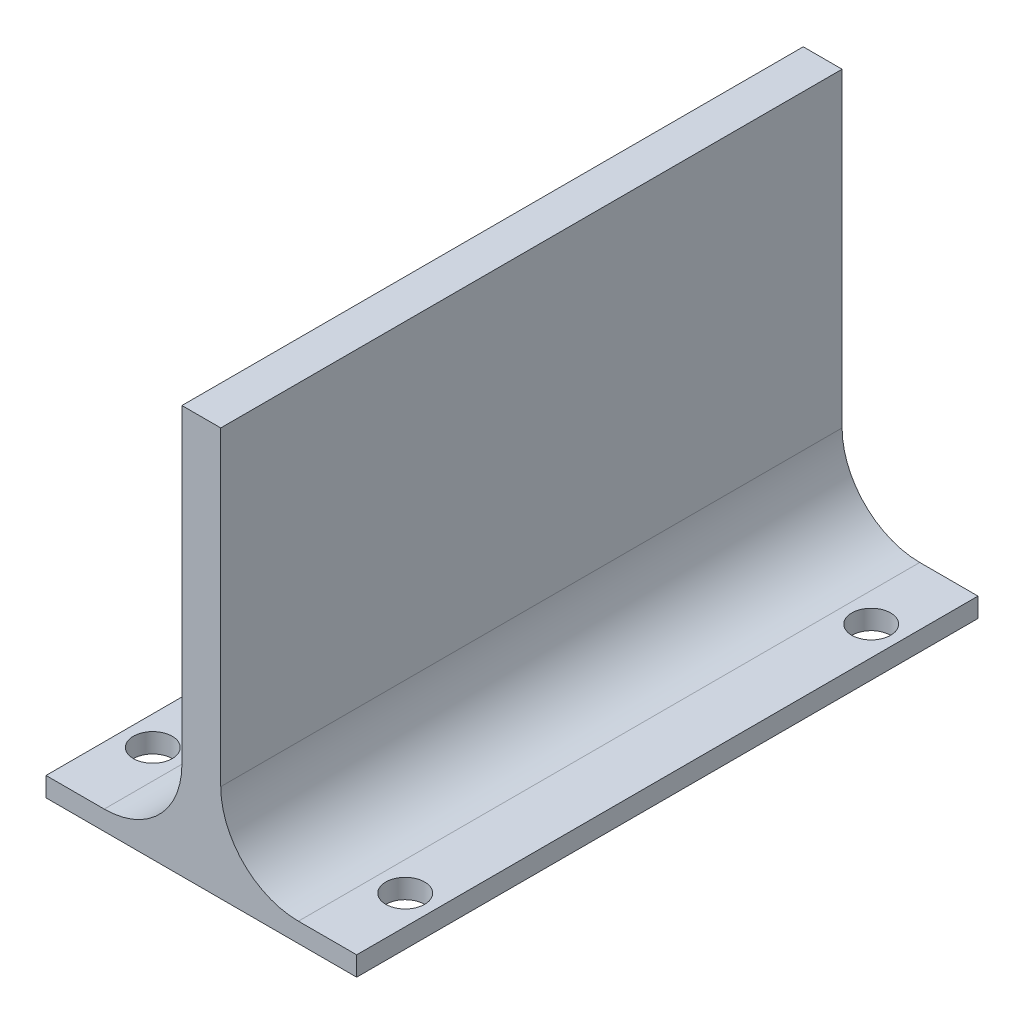
ISO-10303-21;
HEADER;
FILE_DESCRIPTION(('STEP AP214'),'2;1');
FILE_NAME('part.step','',(''),(''),'','','');
FILE_SCHEMA(('AUTOMOTIVE_DESIGN { 1 0 10303 214 1 1 1 1 }'));
ENDSEC;
DATA;
#1=APPLICATION_CONTEXT('core data for automotive mechanical design processes');
#2=APPLICATION_PROTOCOL_DEFINITION('international standard','automotive_design',2000,#1);
#3=PRODUCT_CONTEXT('',#1,'mechanical');
#4=PRODUCT('Part','Part','',(#3));
#5=PRODUCT_RELATED_PRODUCT_CATEGORY('part','',(#4));
#6=PRODUCT_DEFINITION_FORMATION('','',#4);
#7=PRODUCT_DEFINITION_CONTEXT('part definition',#1,'design');
#8=PRODUCT_DEFINITION('design','',#6,#7);
#9=PRODUCT_DEFINITION_SHAPE('','',#8);
#10=(LENGTH_UNIT() NAMED_UNIT(*) SI_UNIT(.MILLI.,.METRE.));
#11=(NAMED_UNIT(*) PLANE_ANGLE_UNIT() SI_UNIT($,.RADIAN.));
#12=(NAMED_UNIT(*) SI_UNIT($,.STERADIAN.) SOLID_ANGLE_UNIT());
#13=UNCERTAINTY_MEASURE_WITH_UNIT(LENGTH_MEASURE(1.E-05),#10,'distance_accuracy_value','');
#14=(GEOMETRIC_REPRESENTATION_CONTEXT(3) GLOBAL_UNCERTAINTY_ASSIGNED_CONTEXT((#13)) GLOBAL_UNIT_ASSIGNED_CONTEXT((#10,
#11,#12)) REPRESENTATION_CONTEXT('',''));
#15=CARTESIAN_POINT('',(0.,0.,0.));
#16=DIRECTION('',(0.,0.,1.));
#17=DIRECTION('',(1.,0.,0.));
#18=AXIS2_PLACEMENT_3D('',#15,#16,#17);
#19=CARTESIAN_POINT('',(35.,0.,160.));
#20=DIRECTION('',(-1.,0.,0.));
#21=DIRECTION('',(0.,0.,1.));
#22=AXIS2_PLACEMENT_3D('',#19,#20,#21);
#23=PLANE('',#22);
#24=DIRECTION('',(0.,1.,0.));
#25=VECTOR('',#24,1.);
#26=CARTESIAN_POINT('',(35.,0.,0.));
#27=LINE('',#26,#25);
#28=CARTESIAN_POINT('',(35.,20.,0.));
#29=VERTEX_POINT('',#28);
#30=CARTESIAN_POINT('',(35.,100.,0.));
#31=VERTEX_POINT('',#30);
#32=EDGE_CURVE('E166',#29,#31,#27,.T.);
#33=ORIENTED_EDGE('',*,*,#32,.F.);
#34=DIRECTION('',(0.,0.,-1.));
#35=VECTOR('',#34,1.);
#36=CARTESIAN_POINT('',(35.,20.,160.));
#37=LINE('',#36,#35);
#38=CARTESIAN_POINT('',(35.,20.,160.));
#39=VERTEX_POINT('',#38);
#40=EDGE_CURVE('E193',#29,#39,#37,.F.);
#41=ORIENTED_EDGE('',*,*,#40,.T.);
#42=DIRECTION('',(0.,1.,0.));
#43=VECTOR('',#42,1.);
#44=CARTESIAN_POINT('',(35.,0.,160.));
#45=LINE('',#44,#43);
#46=CARTESIAN_POINT('',(35.,100.,160.));
#47=VERTEX_POINT('',#46);
#48=EDGE_CURVE('E146',#39,#47,#45,.T.);
#49=ORIENTED_EDGE('',*,*,#48,.T.);
#50=DIRECTION('',(0.,0.,-1.));
#51=VECTOR('',#50,1.);
#52=CARTESIAN_POINT('',(35.,100.,160.));
#53=LINE('',#52,#51);
#54=EDGE_CURVE('E165',#47,#31,#53,.T.);
#55=ORIENTED_EDGE('',*,*,#54,.T.);
#56=EDGE_LOOP('',(#33,#41,#49,#55));
#57=FACE_BOUND('',#56,.T.);
#58=ADVANCED_FACE('F43',(#57),#23,.T.);
#59=CARTESIAN_POINT('',(0.,0.,160.));
#60=DIRECTION('',(0.,1.,0.));
#61=DIRECTION('',(0.,0.,1.));
#62=AXIS2_PLACEMENT_3D('',#59,#60,#61);
#63=PLANE('',#62);
#64=CARTESIAN_POINT('',(7.5,0.,20.));
#65=DIRECTION('',(0.,1.,0.));
#66=DIRECTION('',(0.,0.,1.));
#67=AXIS2_PLACEMENT_3D('',#64,#65,#66);
#68=CIRCLE('',#67,5.);
#69=CARTESIAN_POINT('',(7.5,0.,25.));
#70=VERTEX_POINT('',#69);
#71=EDGE_CURVE('E220',#70,#70,#68,.T.);
#72=ORIENTED_EDGE('',*,*,#71,.F.);
#73=EDGE_LOOP('',(#72));
#74=FACE_BOUND('',#73,.T.);
#75=CARTESIAN_POINT('',(7.5,0.,140.));
#76=DIRECTION('',(0.,1.,0.));
#77=DIRECTION('',(0.,0.,1.));
#78=AXIS2_PLACEMENT_3D('',#75,#76,#77);
#79=CIRCLE('',#78,5.);
#80=CARTESIAN_POINT('',(7.5,0.,145.));
#81=VERTEX_POINT('',#80);
#82=EDGE_CURVE('E223',#81,#81,#79,.T.);
#83=ORIENTED_EDGE('',*,*,#82,.F.);
#84=EDGE_LOOP('',(#83));
#85=FACE_BOUND('',#84,.T.);
#86=DIRECTION('',(1.,0.,0.));
#87=VECTOR('',#86,1.);
#88=CARTESIAN_POINT('',(0.,0.,160.));
#89=LINE('',#88,#87);
#90=CARTESIAN_POINT('',(0.,0.,160.));
#91=VERTEX_POINT('',#90);
#92=CARTESIAN_POINT('',(15.,0.,160.));
#93=VERTEX_POINT('',#92);
#94=EDGE_CURVE('E125',#91,#93,#89,.T.);
#95=ORIENTED_EDGE('',*,*,#94,.T.);
#96=DIRECTION('',(0.,0.,-1.));
#97=VECTOR('',#96,1.);
#98=CARTESIAN_POINT('',(15.,0.,0.));
#99=LINE('',#98,#97);
#100=CARTESIAN_POINT('',(15.,0.,0.));
#101=VERTEX_POINT('',#100);
#102=EDGE_CURVE('E131',#93,#101,#99,.T.);
#103=ORIENTED_EDGE('',*,*,#102,.T.);
#104=DIRECTION('',(1.,0.,0.));
#105=VECTOR('',#104,1.);
#106=CARTESIAN_POINT('',(0.,0.,0.));
#107=LINE('',#106,#105);
#108=CARTESIAN_POINT('',(0.,0.,0.));
#109=VERTEX_POINT('',#108);
#110=EDGE_CURVE('E128',#109,#101,#107,.T.);
#111=ORIENTED_EDGE('',*,*,#110,.F.);
#112=DIRECTION('',(0.,0.,-1.));
#113=VECTOR('',#112,1.);
#114=CARTESIAN_POINT('',(0.,0.,160.));
#115=LINE('',#114,#113);
#116=EDGE_CURVE('E120',#91,#109,#115,.T.);
#117=ORIENTED_EDGE('',*,*,#116,.F.);
#118=EDGE_LOOP('',(#95,#103,#111,#117));
#119=FACE_BOUND('',#118,.T.);
#120=ADVANCED_FACE('F122',(#74,#85,#119),#63,.T.);
#121=CARTESIAN_POINT('',(0.,0.,160.));
#122=DIRECTION('',(1.,0.,0.));
#123=DIRECTION('',(0.,0.,-1.));
#124=AXIS2_PLACEMENT_3D('',#121,#122,#123);
#125=PLANE('',#124);
#126=DIRECTION('',(0.,-1.,0.));
#127=VECTOR('',#126,1.);
#128=CARTESIAN_POINT('',(0.,0.,0.));
#129=LINE('',#128,#127);
#130=CARTESIAN_POINT('',(0.,-5.,0.));
#131=VERTEX_POINT('',#130);
#132=EDGE_CURVE('E169',#109,#131,#129,.T.);
#133=ORIENTED_EDGE('',*,*,#132,.T.);
#134=DIRECTION('',(0.,0.,-1.));
#135=VECTOR('',#134,1.);
#136=CARTESIAN_POINT('',(0.,-5.,160.));
#137=LINE('',#136,#135);
#138=CARTESIAN_POINT('',(0.,-5.,160.));
#139=VERTEX_POINT('',#138);
#140=EDGE_CURVE('E132',#139,#131,#137,.T.);
#141=ORIENTED_EDGE('',*,*,#140,.F.);
#142=DIRECTION('',(0.,-1.,0.));
#143=VECTOR('',#142,1.);
#144=CARTESIAN_POINT('',(0.,0.,160.));
#145=LINE('',#144,#143);
#146=EDGE_CURVE('E135',#91,#139,#145,.T.);
#147=ORIENTED_EDGE('',*,*,#146,.F.);
#148=ORIENTED_EDGE('',*,*,#116,.T.);
#149=EDGE_LOOP('',(#133,#141,#147,#148));
#150=FACE_BOUND('',#149,.T.);
#151=ADVANCED_FACE('F136',(#150),#125,.F.);
#152=CARTESIAN_POINT('',(0.,-5.,160.));
#153=DIRECTION('',(0.,1.,0.));
#154=DIRECTION('',(0.,0.,1.));
#155=AXIS2_PLACEMENT_3D('',#152,#153,#154);
#156=PLANE('',#155);
#157=CARTESIAN_POINT('',(7.5,-5.,20.));
#158=DIRECTION('',(0.,1.,0.));
#159=DIRECTION('',(0.,0.,1.));
#160=AXIS2_PLACEMENT_3D('',#157,#158,#159);
#161=CIRCLE('',#160,5.);
#162=CARTESIAN_POINT('',(7.5,-5.,25.));
#163=VERTEX_POINT('',#162);
#164=EDGE_CURVE('E47',#163,#163,#161,.T.);
#165=ORIENTED_EDGE('',*,*,#164,.T.);
#166=EDGE_LOOP('',(#165));
#167=FACE_BOUND('',#166,.T.);
#168=CARTESIAN_POINT('',(7.5,-5.,140.));
#169=DIRECTION('',(0.,1.,0.));
#170=DIRECTION('',(0.,0.,1.));
#171=AXIS2_PLACEMENT_3D('',#168,#169,#170);
#172=CIRCLE('',#171,5.);
#173=CARTESIAN_POINT('',(7.5,-5.,145.));
#174=VERTEX_POINT('',#173);
#175=EDGE_CURVE('E202',#174,#174,#172,.T.);
#176=ORIENTED_EDGE('',*,*,#175,.T.);
#177=EDGE_LOOP('',(#176));
#178=FACE_BOUND('',#177,.T.);
#179=CARTESIAN_POINT('',(72.5,-5.,140.));
#180=DIRECTION('',(0.,1.,0.));
#181=DIRECTION('',(0.,0.,1.));
#182=AXIS2_PLACEMENT_3D('',#179,#180,#181);
#183=CIRCLE('',#182,5.00000000000001);
#184=CARTESIAN_POINT('',(72.5,-5.,145.));
#185=VERTEX_POINT('',#184);
#186=EDGE_CURVE('E204',#185,#185,#183,.T.);
#187=ORIENTED_EDGE('',*,*,#186,.T.);
#188=EDGE_LOOP('',(#187));
#189=FACE_BOUND('',#188,.T.);
#190=CARTESIAN_POINT('',(72.5,-5.,20.));
#191=DIRECTION('',(0.,1.,0.));
#192=DIRECTION('',(0.,0.,1.));
#193=AXIS2_PLACEMENT_3D('',#190,#191,#192);
#194=CIRCLE('',#193,5.);
#195=CARTESIAN_POINT('',(72.5,-5.,25.));
#196=VERTEX_POINT('',#195);
#197=EDGE_CURVE('E209',#196,#196,#194,.T.);
#198=ORIENTED_EDGE('',*,*,#197,.T.);
#199=EDGE_LOOP('',(#198));
#200=FACE_BOUND('',#199,.T.);
#201=DIRECTION('',(1.,0.,0.));
#202=VECTOR('',#201,1.);
#203=CARTESIAN_POINT('',(0.,-5.,0.));
#204=LINE('',#203,#202);
#205=CARTESIAN_POINT('',(80.,-5.,0.));
#206=VERTEX_POINT('',#205);
#207=EDGE_CURVE('E172',#131,#206,#204,.T.);
#208=ORIENTED_EDGE('',*,*,#207,.T.);
#209=DIRECTION('',(0.,0.,-1.));
#210=VECTOR('',#209,1.);
#211=CARTESIAN_POINT('',(80.,-5.,160.));
#212=LINE('',#211,#210);
#213=CARTESIAN_POINT('',(80.,-5.,160.));
#214=VERTEX_POINT('',#213);
#215=EDGE_CURVE('E189',#214,#206,#212,.T.);
#216=ORIENTED_EDGE('',*,*,#215,.F.);
#217=DIRECTION('',(1.,0.,0.));
#218=VECTOR('',#217,1.);
#219=CARTESIAN_POINT('',(0.,-5.,160.));
#220=LINE('',#219,#218);
#221=EDGE_CURVE('E140',#139,#214,#220,.T.);
#222=ORIENTED_EDGE('',*,*,#221,.F.);
#223=ORIENTED_EDGE('',*,*,#140,.T.);
#224=EDGE_LOOP('',(#208,#216,#222,#223));
#225=FACE_BOUND('',#224,.T.);
#226=ADVANCED_FACE('F259',(#167,#178,#189,#200,#225),#156,.F.);
#227=CARTESIAN_POINT('',(80.,2.22044604925031E-13,160.));
#228=DIRECTION('',(1.,0.,0.));
#229=DIRECTION('',(0.,1.,0.));
#230=AXIS2_PLACEMENT_3D('',#227,#228,#229);
#231=PLANE('',#230);
#232=DIRECTION('',(0.,-1.,0.));
#233=VECTOR('',#232,1.);
#234=CARTESIAN_POINT('',(80.,2.22044604925031E-13,0.));
#235=LINE('',#234,#233);
#236=CARTESIAN_POINT('',(80.,0.,0.));
#237=VERTEX_POINT('',#236);
#238=EDGE_CURVE('E175',#237,#206,#235,.T.);
#239=ORIENTED_EDGE('',*,*,#238,.F.);
#240=DIRECTION('',(0.,0.,-1.));
#241=VECTOR('',#240,1.);
#242=CARTESIAN_POINT('',(80.,0.,160.));
#243=LINE('',#242,#241);
#244=CARTESIAN_POINT('',(80.,0.,160.));
#245=VERTEX_POINT('',#244);
#246=EDGE_CURVE('E187',#245,#237,#243,.T.);
#247=ORIENTED_EDGE('',*,*,#246,.F.);
#248=DIRECTION('',(0.,-1.,0.));
#249=VECTOR('',#248,1.);
#250=CARTESIAN_POINT('',(80.,2.22044604925031E-13,160.));
#251=LINE('',#250,#249);
#252=EDGE_CURVE('E152',#245,#214,#251,.T.);
#253=ORIENTED_EDGE('',*,*,#252,.T.);
#254=ORIENTED_EDGE('',*,*,#215,.T.);
#255=EDGE_LOOP('',(#239,#247,#253,#254));
#256=FACE_BOUND('',#255,.T.);
#257=ADVANCED_FACE('F236',(#256),#231,.T.);
#258=CARTESIAN_POINT('',(72.5,0.,140.));
#259=DIRECTION('',(0.,1.,0.));
#260=DIRECTION('',(0.,0.,1.));
#261=AXIS2_PLACEMENT_3D('',#258,#259,#260);
#262=CIRCLE('',#261,5.00000000000001);
#263=CARTESIAN_POINT('',(72.5,0.,145.));
#264=VERTEX_POINT('',#263);
#265=EDGE_CURVE('E219',#264,#264,#262,.T.);
#266=ORIENTED_EDGE('',*,*,#265,.F.);
#267=EDGE_LOOP('',(#266));
#268=FACE_BOUND('',#267,.T.);
#269=CARTESIAN_POINT('',(72.5,0.,20.));
#270=DIRECTION('',(0.,1.,0.));
#271=DIRECTION('',(0.,0.,1.));
#272=AXIS2_PLACEMENT_3D('',#269,#270,#271);
#273=CIRCLE('',#272,5.);
#274=CARTESIAN_POINT('',(72.5,0.,25.));
#275=VERTEX_POINT('',#274);
#276=EDGE_CURVE('E214',#275,#275,#273,.T.);
#277=ORIENTED_EDGE('',*,*,#276,.F.);
#278=EDGE_LOOP('',(#277));
#279=FACE_BOUND('',#278,.T.);
#280=CARTESIAN_POINT('',(65.,0.,0.));
#281=VERTEX_POINT('',#280);
#282=EDGE_CURVE('E170',#281,#237,#107,.T.);
#283=ORIENTED_EDGE('',*,*,#282,.F.);
#284=DIRECTION('',(0.,0.,-1.));
#285=VECTOR('',#284,1.);
#286=CARTESIAN_POINT('',(65.,0.,160.));
#287=LINE('',#286,#285);
#288=CARTESIAN_POINT('',(65.,0.,160.));
#289=VERTEX_POINT('',#288);
#290=EDGE_CURVE('E60',#281,#289,#287,.F.);
#291=ORIENTED_EDGE('',*,*,#290,.T.);
#292=EDGE_CURVE('E148',#289,#245,#89,.T.);
#293=ORIENTED_EDGE('',*,*,#292,.T.);
#294=ORIENTED_EDGE('',*,*,#246,.T.);
#295=EDGE_LOOP('',(#283,#291,#293,#294));
#296=FACE_BOUND('',#295,.T.);
#297=ADVANCED_FACE('F232',(#268,#279,#296),#63,.T.);
#298=CARTESIAN_POINT('',(45.,0.,160.));
#299=DIRECTION('',(-1.,0.,0.));
#300=DIRECTION('',(0.,0.,1.));
#301=AXIS2_PLACEMENT_3D('',#298,#299,#300);
#302=PLANE('',#301);
#303=DIRECTION('',(0.,1.,0.));
#304=VECTOR('',#303,1.);
#305=CARTESIAN_POINT('',(45.,0.,160.));
#306=LINE('',#305,#304);
#307=CARTESIAN_POINT('',(45.,20.,160.));
#308=VERTEX_POINT('',#307);
#309=CARTESIAN_POINT('',(45.,100.,160.));
#310=VERTEX_POINT('',#309);
#311=EDGE_CURVE('E151',#308,#310,#306,.T.);
#312=ORIENTED_EDGE('',*,*,#311,.F.);
#313=DIRECTION('',(0.,0.,-1.));
#314=VECTOR('',#313,1.);
#315=CARTESIAN_POINT('',(45.,20.,160.));
#316=LINE('',#315,#314);
#317=CARTESIAN_POINT('',(45.,20.,0.));
#318=VERTEX_POINT('',#317);
#319=EDGE_CURVE('E195',#308,#318,#316,.T.);
#320=ORIENTED_EDGE('',*,*,#319,.T.);
#321=DIRECTION('',(0.,1.,0.));
#322=VECTOR('',#321,1.);
#323=CARTESIAN_POINT('',(45.,0.,0.));
#324=LINE('',#323,#322);
#325=CARTESIAN_POINT('',(45.,100.,0.));
#326=VERTEX_POINT('',#325);
#327=EDGE_CURVE('E178',#318,#326,#324,.T.);
#328=ORIENTED_EDGE('',*,*,#327,.T.);
#329=DIRECTION('',(0.,0.,-1.));
#330=VECTOR('',#329,1.);
#331=CARTESIAN_POINT('',(45.,100.,160.));
#332=LINE('',#331,#330);
#333=EDGE_CURVE('E184',#310,#326,#332,.T.);
#334=ORIENTED_EDGE('',*,*,#333,.F.);
#335=EDGE_LOOP('',(#312,#320,#328,#334));
#336=FACE_BOUND('',#335,.T.);
#337=ADVANCED_FACE('F235',(#336),#302,.F.);
#338=CARTESIAN_POINT('',(0.,100.,160.));
#339=DIRECTION('',(0.,1.,0.));
#340=DIRECTION('',(0.,0.,1.));
#341=AXIS2_PLACEMENT_3D('',#338,#339,#340);
#342=PLANE('',#341);
#343=DIRECTION('',(1.,0.,0.));
#344=VECTOR('',#343,1.);
#345=CARTESIAN_POINT('',(0.,100.,0.));
#346=LINE('',#345,#344);
#347=EDGE_CURVE('E149',#31,#326,#346,.T.);
#348=ORIENTED_EDGE('',*,*,#347,.F.);
#349=ORIENTED_EDGE('',*,*,#54,.F.);
#350=DIRECTION('',(1.,0.,0.));
#351=VECTOR('',#350,1.);
#352=CARTESIAN_POINT('',(0.,100.,160.));
#353=LINE('',#352,#351);
#354=EDGE_CURVE('E155',#47,#310,#353,.T.);
#355=ORIENTED_EDGE('',*,*,#354,.T.);
#356=ORIENTED_EDGE('',*,*,#333,.T.);
#357=EDGE_LOOP('',(#348,#349,#355,#356));
#358=FACE_BOUND('',#357,.T.);
#359=ADVANCED_FACE('F250',(#358),#342,.T.);
#360=CARTESIAN_POINT('',(0.,0.,160.));
#361=DIRECTION('',(0.,0.,1.));
#362=DIRECTION('',(1.,0.,0.));
#363=AXIS2_PLACEMENT_3D('',#360,#361,#362);
#364=PLANE('',#363);
#365=ORIENTED_EDGE('',*,*,#48,.F.);
#366=CARTESIAN_POINT('',(15.,20.,160.));
#367=DIRECTION('',(0.,0.,1.));
#368=DIRECTION('',(1.,0.,0.));
#369=AXIS2_PLACEMENT_3D('',#366,#367,#368);
#370=CIRCLE('',#369,20.);
#371=EDGE_CURVE('E145',#39,#93,#370,.F.);
#372=ORIENTED_EDGE('',*,*,#371,.T.);
#373=ORIENTED_EDGE('',*,*,#94,.F.);
#374=ORIENTED_EDGE('',*,*,#146,.T.);
#375=ORIENTED_EDGE('',*,*,#221,.T.);
#376=ORIENTED_EDGE('',*,*,#252,.F.);
#377=ORIENTED_EDGE('',*,*,#292,.F.);
#378=CARTESIAN_POINT('',(65.,20.,160.));
#379=DIRECTION('',(0.,0.,1.));
#380=DIRECTION('',(1.,0.,0.));
#381=AXIS2_PLACEMENT_3D('',#378,#379,#380);
#382=CIRCLE('',#381,20.);
#383=EDGE_CURVE('E11',#289,#308,#382,.F.);
#384=ORIENTED_EDGE('',*,*,#383,.T.);
#385=ORIENTED_EDGE('',*,*,#311,.T.);
#386=ORIENTED_EDGE('',*,*,#354,.F.);
#387=EDGE_LOOP('',(#365,#372,#373,#374,#375,#376,#377,#384,#385,#386));
#388=FACE_BOUND('',#387,.T.);
#389=ADVANCED_FACE('F143',(#388),#364,.T.);
#390=CARTESIAN_POINT('',(0.,0.,0.));
#391=DIRECTION('',(0.,0.,1.));
#392=DIRECTION('',(1.,0.,0.));
#393=AXIS2_PLACEMENT_3D('',#390,#391,#392);
#394=PLANE('',#393);
#395=ORIENTED_EDGE('',*,*,#110,.T.);
#396=CARTESIAN_POINT('',(15.,20.,0.));
#397=DIRECTION('',(0.,0.,1.));
#398=DIRECTION('',(1.,0.,0.));
#399=AXIS2_PLACEMENT_3D('',#396,#397,#398);
#400=CIRCLE('',#399,20.);
#401=EDGE_CURVE('E199',#101,#29,#400,.T.);
#402=ORIENTED_EDGE('',*,*,#401,.T.);
#403=ORIENTED_EDGE('',*,*,#32,.T.);
#404=ORIENTED_EDGE('',*,*,#347,.T.);
#405=ORIENTED_EDGE('',*,*,#327,.F.);
#406=CARTESIAN_POINT('',(65.,20.,0.));
#407=DIRECTION('',(0.,0.,1.));
#408=DIRECTION('',(1.,0.,0.));
#409=AXIS2_PLACEMENT_3D('',#406,#407,#408);
#410=CIRCLE('',#409,20.);
#411=EDGE_CURVE('E52',#318,#281,#410,.T.);
#412=ORIENTED_EDGE('',*,*,#411,.T.);
#413=ORIENTED_EDGE('',*,*,#282,.T.);
#414=ORIENTED_EDGE('',*,*,#238,.T.);
#415=ORIENTED_EDGE('',*,*,#207,.F.);
#416=ORIENTED_EDGE('',*,*,#132,.F.);
#417=EDGE_LOOP('',(#395,#402,#403,#404,#405,#412,#413,#414,#415,#416));
#418=FACE_BOUND('',#417,.T.);
#419=ADVANCED_FACE('F255',(#418),#394,.F.);
#420=CARTESIAN_POINT('',(15.,20.,160.));
#421=DIRECTION('',(0.,0.,1.));
#422=DIRECTION('',(1.,0.,0.));
#423=AXIS2_PLACEMENT_3D('',#420,#421,#422);
#424=CYLINDRICAL_SURFACE('',#423,20.);
#425=ORIENTED_EDGE('',*,*,#371,.F.);
#426=ORIENTED_EDGE('',*,*,#40,.F.);
#427=ORIENTED_EDGE('',*,*,#401,.F.);
#428=ORIENTED_EDGE('',*,*,#102,.F.);
#429=EDGE_LOOP('',(#425,#426,#427,#428));
#430=FACE_BOUND('',#429,.T.);
#431=ADVANCED_FACE('F254',(#430),#424,.F.);
#432=CARTESIAN_POINT('',(65.,20.,160.));
#433=DIRECTION('',(0.,0.,-1.));
#434=DIRECTION('',(-1.,0.,0.));
#435=AXIS2_PLACEMENT_3D('',#432,#433,#434);
#436=CYLINDRICAL_SURFACE('',#435,20.);
#437=ORIENTED_EDGE('',*,*,#383,.F.);
#438=ORIENTED_EDGE('',*,*,#290,.F.);
#439=ORIENTED_EDGE('',*,*,#411,.F.);
#440=ORIENTED_EDGE('',*,*,#319,.F.);
#441=EDGE_LOOP('',(#437,#438,#439,#440));
#442=FACE_BOUND('',#441,.T.);
#443=ADVANCED_FACE('F45',(#442),#436,.F.);
#444=CARTESIAN_POINT('',(72.5,-10.,20.));
#445=DIRECTION('',(0.,1.,0.));
#446=DIRECTION('',(0.,0.,1.));
#447=AXIS2_PLACEMENT_3D('',#444,#445,#446);
#448=CYLINDRICAL_SURFACE('',#447,5.);
#449=ORIENTED_EDGE('',*,*,#276,.T.);
#450=EDGE_LOOP('',(#449));
#451=FACE_BOUND('',#450,.T.);
#452=ORIENTED_EDGE('',*,*,#197,.F.);
#453=EDGE_LOOP('',(#452));
#454=FACE_BOUND('',#453,.T.);
#455=ADVANCED_FACE('F280',(#451,#454),#448,.F.);
#456=CARTESIAN_POINT('',(72.5,-10.,140.));
#457=DIRECTION('',(0.,1.,0.));
#458=DIRECTION('',(0.,0.,1.));
#459=AXIS2_PLACEMENT_3D('',#456,#457,#458);
#460=CYLINDRICAL_SURFACE('',#459,5.00000000000001);
#461=ORIENTED_EDGE('',*,*,#265,.T.);
#462=EDGE_LOOP('',(#461));
#463=FACE_BOUND('',#462,.T.);
#464=ORIENTED_EDGE('',*,*,#186,.F.);
#465=EDGE_LOOP('',(#464));
#466=FACE_BOUND('',#465,.T.);
#467=ADVANCED_FACE('F229',(#463,#466),#460,.F.);
#468=CARTESIAN_POINT('',(7.5,-10.,140.));
#469=DIRECTION('',(0.,1.,0.));
#470=DIRECTION('',(0.,0.,1.));
#471=AXIS2_PLACEMENT_3D('',#468,#469,#470);
#472=CYLINDRICAL_SURFACE('',#471,5.);
#473=ORIENTED_EDGE('',*,*,#82,.T.);
#474=EDGE_LOOP('',(#473));
#475=FACE_BOUND('',#474,.T.);
#476=ORIENTED_EDGE('',*,*,#175,.F.);
#477=EDGE_LOOP('',(#476));
#478=FACE_BOUND('',#477,.T.);
#479=ADVANCED_FACE('F361',(#475,#478),#472,.F.);
#480=CARTESIAN_POINT('',(7.5,-10.,20.));
#481=DIRECTION('',(0.,1.,0.));
#482=DIRECTION('',(0.,0.,1.));
#483=AXIS2_PLACEMENT_3D('',#480,#481,#482);
#484=CYLINDRICAL_SURFACE('',#483,5.);
#485=ORIENTED_EDGE('',*,*,#71,.T.);
#486=EDGE_LOOP('',(#485));
#487=FACE_BOUND('',#486,.T.);
#488=ORIENTED_EDGE('',*,*,#164,.F.);
#489=EDGE_LOOP('',(#488));
#490=FACE_BOUND('',#489,.T.);
#491=ADVANCED_FACE('F371',(#487,#490),#484,.F.);
#492=CLOSED_SHELL('',(#58,#120,#151,#226,#257,#297,#337,#359,#389,#419,#431,#443,#455,#467,#479,#491));
#493=MANIFOLD_SOLID_BREP('B2',#492);
#494=ADVANCED_BREP_SHAPE_REPRESENTATION('',(#18,#493),#14);
#495=SHAPE_DEFINITION_REPRESENTATION(#9,#494);
ENDSEC;
END-ISO-10303-21;
